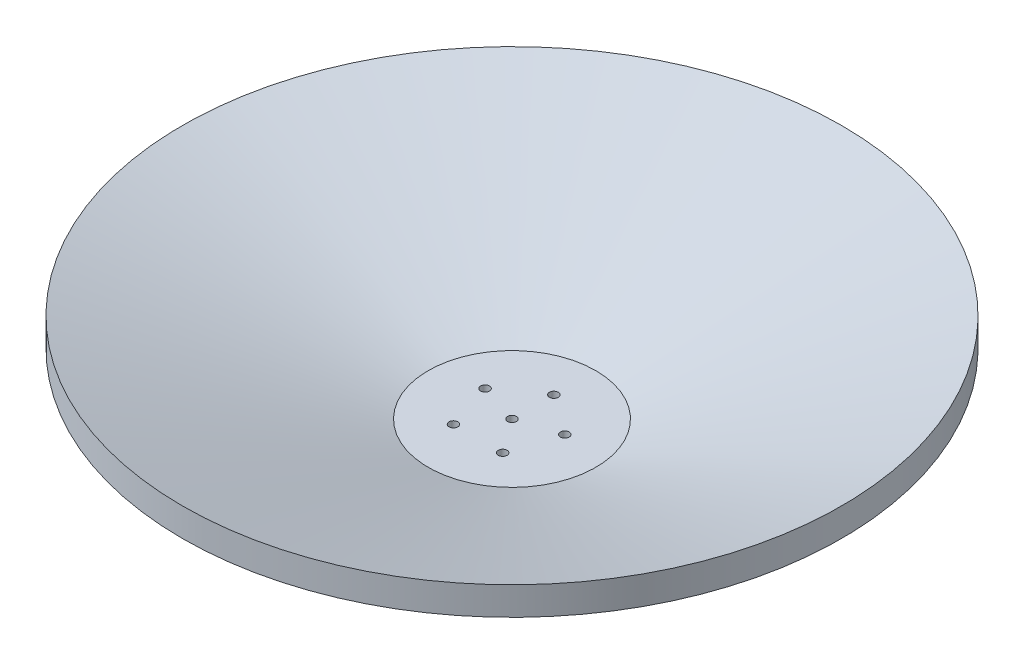
ISO-10303-21;
HEADER;
FILE_DESCRIPTION(('STEP AP214'),'2;1');
FILE_NAME('part.step','',(''),(''),'','','');
FILE_SCHEMA(('AUTOMOTIVE_DESIGN { 1 0 10303 214 1 1 1 1 }'));
ENDSEC;
DATA;
#1=APPLICATION_CONTEXT('core data for automotive mechanical design processes');
#2=APPLICATION_PROTOCOL_DEFINITION('international standard','automotive_design',2000,#1);
#3=PRODUCT_CONTEXT('',#1,'mechanical');
#4=PRODUCT('Part','Part','',(#3));
#5=PRODUCT_RELATED_PRODUCT_CATEGORY('part','',(#4));
#6=PRODUCT_DEFINITION_FORMATION('','',#4);
#7=PRODUCT_DEFINITION_CONTEXT('part definition',#1,'design');
#8=PRODUCT_DEFINITION('design','',#6,#7);
#9=PRODUCT_DEFINITION_SHAPE('','',#8);
#10=(LENGTH_UNIT() NAMED_UNIT(*) SI_UNIT(.MILLI.,.METRE.));
#11=(NAMED_UNIT(*) PLANE_ANGLE_UNIT() SI_UNIT($,.RADIAN.));
#12=(NAMED_UNIT(*) SI_UNIT($,.STERADIAN.) SOLID_ANGLE_UNIT());
#13=UNCERTAINTY_MEASURE_WITH_UNIT(LENGTH_MEASURE(1.E-05),#10,'distance_accuracy_value','');
#14=(GEOMETRIC_REPRESENTATION_CONTEXT(3) GLOBAL_UNCERTAINTY_ASSIGNED_CONTEXT((#13)) GLOBAL_UNIT_ASSIGNED_CONTEXT((#10,
#11,#12)) REPRESENTATION_CONTEXT('',''));
#15=CARTESIAN_POINT('',(0.,0.,0.));
#16=DIRECTION('',(0.,0.,1.));
#17=DIRECTION('',(1.,0.,0.));
#18=AXIS2_PLACEMENT_3D('',#15,#16,#17);
#19=CARTESIAN_POINT('',(0.,3.,0.));
#20=DIRECTION('',(0.,1.,0.));
#21=DIRECTION('',(0.,0.,1.));
#22=AXIS2_PLACEMENT_3D('',#19,#20,#21);
#23=PLANE('',#22);
#24=CARTESIAN_POINT('',(4.50373719547362,3.,-1.46335292146612));
#25=DIRECTION('',(0.,1.,0.));
#26=DIRECTION('',(0.,0.,1.));
#27=AXIS2_PLACEMENT_3D('',#24,#25,#26);
#28=CIRCLE('',#27,0.500000000000001);
#29=CARTESIAN_POINT('',(4.50373719547362,3.,-0.963352921466115));
#30=VERTEX_POINT('',#29);
#31=EDGE_CURVE('E65',#30,#30,#28,.T.);
#32=ORIENTED_EDGE('',*,*,#31,.F.);
#33=EDGE_LOOP('',(#32));
#34=FACE_BOUND('',#33,.T.);
#35=CARTESIAN_POINT('',(0.,3.,0.));
#36=DIRECTION('',(0.,1.,0.));
#37=DIRECTION('',(0.,0.,1.));
#38=AXIS2_PLACEMENT_3D('',#35,#36,#37);
#39=CIRCLE('',#38,0.5);
#40=CARTESIAN_POINT('',(0.,3.,0.5));
#41=VERTEX_POINT('',#40);
#42=EDGE_CURVE('E110',#41,#41,#39,.T.);
#43=ORIENTED_EDGE('',*,*,#42,.F.);
#44=EDGE_LOOP('',(#43));
#45=FACE_BOUND('',#44,.T.);
#46=CARTESIAN_POINT('',(0.,3.,-4.7355095289373));
#47=DIRECTION('',(0.,1.,0.));
#48=DIRECTION('',(0.,0.,1.));
#49=AXIS2_PLACEMENT_3D('',#46,#47,#48);
#50=CIRCLE('',#49,0.5);
#51=CARTESIAN_POINT('',(0.,3.,-4.2355095289373));
#52=VERTEX_POINT('',#51);
#53=EDGE_CURVE('E106',#52,#52,#50,.T.);
#54=ORIENTED_EDGE('',*,*,#53,.F.);
#55=EDGE_LOOP('',(#54));
#56=FACE_BOUND('',#55,.T.);
#57=CARTESIAN_POINT('',(2.7834626631998,3.,3.83110768593479));
#58=DIRECTION('',(0.,1.,0.));
#59=DIRECTION('',(0.,0.,1.));
#60=AXIS2_PLACEMENT_3D('',#57,#58,#59);
#61=CIRCLE('',#60,0.5);
#62=CARTESIAN_POINT('',(2.7834626631998,3.,4.33110768593479));
#63=VERTEX_POINT('',#62);
#64=EDGE_CURVE('E102',#63,#63,#61,.T.);
#65=ORIENTED_EDGE('',*,*,#64,.F.);
#66=EDGE_LOOP('',(#65));
#67=FACE_BOUND('',#66,.T.);
#68=CARTESIAN_POINT('',(-2.78346266319986,3.,3.83110768593475));
#69=DIRECTION('',(0.,1.,0.));
#70=DIRECTION('',(0.,0.,1.));
#71=AXIS2_PLACEMENT_3D('',#68,#69,#70);
#72=CIRCLE('',#71,0.5);
#73=CARTESIAN_POINT('',(-2.78346266319986,3.,4.33110768593475));
#74=VERTEX_POINT('',#73);
#75=EDGE_CURVE('E98',#74,#74,#72,.T.);
#76=ORIENTED_EDGE('',*,*,#75,.F.);
#77=EDGE_LOOP('',(#76));
#78=FACE_BOUND('',#77,.T.);
#79=CARTESIAN_POINT('',(-4.5037371954736,3.,-1.46335292146618));
#80=DIRECTION('',(0.,1.,0.));
#81=DIRECTION('',(0.,0.,1.));
#82=AXIS2_PLACEMENT_3D('',#79,#80,#81);
#83=CIRCLE('',#82,0.5);
#84=CARTESIAN_POINT('',(-4.5037371954736,3.,-0.963352921466179));
#85=VERTEX_POINT('',#84);
#86=EDGE_CURVE('E94',#85,#85,#83,.T.);
#87=ORIENTED_EDGE('',*,*,#86,.F.);
#88=EDGE_LOOP('',(#87));
#89=FACE_BOUND('',#88,.T.);
#90=CARTESIAN_POINT('',(0.,3.,0.));
#91=DIRECTION('',(0.,-1.,0.));
#92=DIRECTION('',(0.,0.,-1.));
#93=AXIS2_PLACEMENT_3D('',#90,#91,#92);
#94=CIRCLE('',#93,9.4710190578746);
#95=CARTESIAN_POINT('',(0.,3.,-9.4710190578746));
#96=VERTEX_POINT('',#95);
#97=EDGE_CURVE('E10',#96,#96,#94,.T.);
#98=ORIENTED_EDGE('',*,*,#97,.F.);
#99=EDGE_LOOP('',(#98));
#100=FACE_BOUND('',#99,.T.);
#101=ADVANCED_FACE('F42',(#34,#45,#56,#67,#78,#89,#100),#23,.T.);
#102=CARTESIAN_POINT('',(0.,13.1107222011818,0.));
#103=DIRECTION('',(0.,1.,0.));
#104=DIRECTION('',(0.,0.,1.));
#105=AXIS2_PLACEMENT_3D('',#102,#103,#104);
#106=CONICAL_SURFACE('',#105,37.25,1.22173047639603);
#107=ORIENTED_EDGE('',*,*,#97,.T.);
#108=EDGE_LOOP('',(#107));
#109=FACE_BOUND('',#108,.T.);
#110=CARTESIAN_POINT('',(0.,13.1107222011818,0.));
#111=DIRECTION('',(0.,-1.,0.));
#112=DIRECTION('',(0.,0.,-1.));
#113=AXIS2_PLACEMENT_3D('',#110,#111,#112);
#114=CIRCLE('',#113,37.25);
#115=CARTESIAN_POINT('',(0.,13.1107222011818,-37.25));
#116=VERTEX_POINT('',#115);
#117=EDGE_CURVE('E50',#116,#116,#114,.T.);
#118=ORIENTED_EDGE('',*,*,#117,.F.);
#119=EDGE_LOOP('',(#118));
#120=FACE_BOUND('',#119,.T.);
#121=ADVANCED_FACE('F122',(#109,#120),#106,.F.);
#122=CARTESIAN_POINT('',(0.,0.,0.));
#123=DIRECTION('',(0.,-1.,0.));
#124=DIRECTION('',(0.,0.,-1.));
#125=AXIS2_PLACEMENT_3D('',#122,#123,#124);
#126=CYLINDRICAL_SURFACE('',#125,37.25);
#127=ORIENTED_EDGE('',*,*,#117,.T.);
#128=EDGE_LOOP('',(#127));
#129=FACE_BOUND('',#128,.T.);
#130=CARTESIAN_POINT('',(0.,9.91818888375406,0.));
#131=DIRECTION('',(0.,-1.,0.));
#132=DIRECTION('',(0.,0.,-1.));
#133=AXIS2_PLACEMENT_3D('',#130,#131,#132);
#134=CIRCLE('',#133,37.25);
#135=CARTESIAN_POINT('',(0.,9.91818888375406,-37.25));
#136=VERTEX_POINT('',#135);
#137=EDGE_CURVE('E56',#136,#136,#134,.T.);
#138=ORIENTED_EDGE('',*,*,#137,.F.);
#139=EDGE_LOOP('',(#138));
#140=FACE_BOUND('',#139,.T.);
#141=ADVANCED_FACE('F154',(#129,#140),#126,.T.);
#142=CARTESIAN_POINT('',(0.,0.,0.));
#143=DIRECTION('',(0.,1.,0.));
#144=DIRECTION('',(0.,0.,1.));
#145=AXIS2_PLACEMENT_3D('',#142,#143,#144);
#146=CONICAL_SURFACE('',#145,10.,1.22173047639603);
#147=ORIENTED_EDGE('',*,*,#137,.T.);
#148=EDGE_LOOP('',(#147));
#149=FACE_BOUND('',#148,.T.);
#150=CARTESIAN_POINT('',(0.,0.,0.));
#151=DIRECTION('',(0.,-1.,0.));
#152=DIRECTION('',(0.,0.,-1.));
#153=AXIS2_PLACEMENT_3D('',#150,#151,#152);
#154=CIRCLE('',#153,10.);
#155=CARTESIAN_POINT('',(0.,0.,-10.));
#156=VERTEX_POINT('',#155);
#157=EDGE_CURVE('E83',#156,#156,#154,.T.);
#158=ORIENTED_EDGE('',*,*,#157,.F.);
#159=EDGE_LOOP('',(#158));
#160=FACE_BOUND('',#159,.T.);
#161=ADVANCED_FACE('F147',(#149,#160),#146,.T.);
#162=CARTESIAN_POINT('',(0.,0.,0.));
#163=DIRECTION('',(0.,-1.,0.));
#164=DIRECTION('',(0.,0.,-1.));
#165=AXIS2_PLACEMENT_3D('',#162,#163,#164);
#166=PLANE('',#165);
#167=CARTESIAN_POINT('',(4.50373719547362,0.,-1.46335292146612));
#168=DIRECTION('',(0.,-1.,0.));
#169=DIRECTION('',(0.,0.,-1.));
#170=AXIS2_PLACEMENT_3D('',#167,#168,#169);
#171=CIRCLE('',#170,0.500000000000001);
#172=CARTESIAN_POINT('',(4.50373719547362,0.,-1.96335292146612));
#173=VERTEX_POINT('',#172);
#174=EDGE_CURVE('E45',#173,#173,#171,.T.);
#175=ORIENTED_EDGE('',*,*,#174,.F.);
#176=EDGE_LOOP('',(#175));
#177=FACE_BOUND('',#176,.T.);
#178=CARTESIAN_POINT('',(0.,0.,0.));
#179=DIRECTION('',(0.,-1.,0.));
#180=DIRECTION('',(0.,0.,-1.));
#181=AXIS2_PLACEMENT_3D('',#178,#179,#180);
#182=CIRCLE('',#181,0.5);
#183=CARTESIAN_POINT('',(0.,0.,-0.5));
#184=VERTEX_POINT('',#183);
#185=EDGE_CURVE('E76',#184,#184,#182,.T.);
#186=ORIENTED_EDGE('',*,*,#185,.F.);
#187=EDGE_LOOP('',(#186));
#188=FACE_BOUND('',#187,.T.);
#189=CARTESIAN_POINT('',(0.,0.,-4.7355095289373));
#190=DIRECTION('',(0.,-1.,0.));
#191=DIRECTION('',(0.,0.,-1.));
#192=AXIS2_PLACEMENT_3D('',#189,#190,#191);
#193=CIRCLE('',#192,0.5);
#194=CARTESIAN_POINT('',(0.,0.,-5.2355095289373));
#195=VERTEX_POINT('',#194);
#196=EDGE_CURVE('E73',#195,#195,#193,.T.);
#197=ORIENTED_EDGE('',*,*,#196,.F.);
#198=EDGE_LOOP('',(#197));
#199=FACE_BOUND('',#198,.T.);
#200=CARTESIAN_POINT('',(2.7834626631998,0.,3.83110768593479));
#201=DIRECTION('',(0.,-1.,0.));
#202=DIRECTION('',(0.,0.,-1.));
#203=AXIS2_PLACEMENT_3D('',#200,#201,#202);
#204=CIRCLE('',#203,0.5);
#205=CARTESIAN_POINT('',(2.7834626631998,0.,3.33110768593479));
#206=VERTEX_POINT('',#205);
#207=EDGE_CURVE('E69',#206,#206,#204,.T.);
#208=ORIENTED_EDGE('',*,*,#207,.F.);
#209=EDGE_LOOP('',(#208));
#210=FACE_BOUND('',#209,.T.);
#211=CARTESIAN_POINT('',(-2.78346266319986,0.,3.83110768593475));
#212=DIRECTION('',(0.,-1.,0.));
#213=DIRECTION('',(0.,0.,-1.));
#214=AXIS2_PLACEMENT_3D('',#211,#212,#213);
#215=CIRCLE('',#214,0.5);
#216=CARTESIAN_POINT('',(-2.78346266319986,0.,3.33110768593475));
#217=VERTEX_POINT('',#216);
#218=EDGE_CURVE('E64',#217,#217,#215,.T.);
#219=ORIENTED_EDGE('',*,*,#218,.F.);
#220=EDGE_LOOP('',(#219));
#221=FACE_BOUND('',#220,.T.);
#222=CARTESIAN_POINT('',(-4.5037371954736,0.,-1.46335292146618));
#223=DIRECTION('',(0.,-1.,0.));
#224=DIRECTION('',(0.,0.,-1.));
#225=AXIS2_PLACEMENT_3D('',#222,#223,#224);
#226=CIRCLE('',#225,0.5);
#227=CARTESIAN_POINT('',(-4.5037371954736,0.,-1.96335292146618));
#228=VERTEX_POINT('',#227);
#229=EDGE_CURVE('E60',#228,#228,#226,.T.);
#230=ORIENTED_EDGE('',*,*,#229,.F.);
#231=EDGE_LOOP('',(#230));
#232=FACE_BOUND('',#231,.T.);
#233=ORIENTED_EDGE('',*,*,#157,.T.);
#234=EDGE_LOOP('',(#233));
#235=FACE_BOUND('',#234,.T.);
#236=ADVANCED_FACE('F137',(#177,#188,#199,#210,#221,#232,#235),#166,.T.);
#237=CARTESIAN_POINT('',(-4.5037371954736,-15.,-1.46335292146618));
#238=DIRECTION('',(0.,1.,0.));
#239=DIRECTION('',(0.,0.,1.));
#240=AXIS2_PLACEMENT_3D('',#237,#238,#239);
#241=CYLINDRICAL_SURFACE('',#240,0.5);
#242=ORIENTED_EDGE('',*,*,#229,.T.);
#243=EDGE_LOOP('',(#242));
#244=FACE_BOUND('',#243,.T.);
#245=ORIENTED_EDGE('',*,*,#86,.T.);
#246=EDGE_LOOP('',(#245));
#247=FACE_BOUND('',#246,.T.);
#248=ADVANCED_FACE('F134',(#244,#247),#241,.F.);
#249=CARTESIAN_POINT('',(-2.78346266319986,-15.,3.83110768593475));
#250=DIRECTION('',(0.,1.,0.));
#251=DIRECTION('',(0.,0.,1.));
#252=AXIS2_PLACEMENT_3D('',#249,#250,#251);
#253=CYLINDRICAL_SURFACE('',#252,0.5);
#254=ORIENTED_EDGE('',*,*,#218,.T.);
#255=EDGE_LOOP('',(#254));
#256=FACE_BOUND('',#255,.T.);
#257=ORIENTED_EDGE('',*,*,#75,.T.);
#258=EDGE_LOOP('',(#257));
#259=FACE_BOUND('',#258,.T.);
#260=ADVANCED_FACE('F136',(#256,#259),#253,.F.);
#261=CARTESIAN_POINT('',(2.7834626631998,-15.,3.83110768593479));
#262=DIRECTION('',(0.,1.,0.));
#263=DIRECTION('',(0.,0.,1.));
#264=AXIS2_PLACEMENT_3D('',#261,#262,#263);
#265=CYLINDRICAL_SURFACE('',#264,0.5);
#266=ORIENTED_EDGE('',*,*,#207,.T.);
#267=EDGE_LOOP('',(#266));
#268=FACE_BOUND('',#267,.T.);
#269=ORIENTED_EDGE('',*,*,#64,.T.);
#270=EDGE_LOOP('',(#269));
#271=FACE_BOUND('',#270,.T.);
#272=ADVANCED_FACE('F144',(#268,#271),#265,.F.);
#273=CARTESIAN_POINT('',(0.,-15.,-4.7355095289373));
#274=DIRECTION('',(0.,1.,0.));
#275=DIRECTION('',(0.,0.,1.));
#276=AXIS2_PLACEMENT_3D('',#273,#274,#275);
#277=CYLINDRICAL_SURFACE('',#276,0.5);
#278=ORIENTED_EDGE('',*,*,#196,.T.);
#279=EDGE_LOOP('',(#278));
#280=FACE_BOUND('',#279,.T.);
#281=ORIENTED_EDGE('',*,*,#53,.T.);
#282=EDGE_LOOP('',(#281));
#283=FACE_BOUND('',#282,.T.);
#284=ADVANCED_FACE('F206',(#280,#283),#277,.F.);
#285=CARTESIAN_POINT('',(0.,-15.,0.));
#286=DIRECTION('',(0.,1.,0.));
#287=DIRECTION('',(0.,0.,1.));
#288=AXIS2_PLACEMENT_3D('',#285,#286,#287);
#289=CYLINDRICAL_SURFACE('',#288,0.5);
#290=ORIENTED_EDGE('',*,*,#185,.T.);
#291=EDGE_LOOP('',(#290));
#292=FACE_BOUND('',#291,.T.);
#293=ORIENTED_EDGE('',*,*,#42,.T.);
#294=EDGE_LOOP('',(#293));
#295=FACE_BOUND('',#294,.T.);
#296=ADVANCED_FACE('F215',(#292,#295),#289,.F.);
#297=CARTESIAN_POINT('',(4.50373719547362,-15.,-1.46335292146612));
#298=DIRECTION('',(0.,1.,0.));
#299=DIRECTION('',(0.,0.,1.));
#300=AXIS2_PLACEMENT_3D('',#297,#298,#299);
#301=CYLINDRICAL_SURFACE('',#300,0.500000000000001);
#302=ORIENTED_EDGE('',*,*,#174,.T.);
#303=EDGE_LOOP('',(#302));
#304=FACE_BOUND('',#303,.T.);
#305=ORIENTED_EDGE('',*,*,#31,.T.);
#306=EDGE_LOOP('',(#305));
#307=FACE_BOUND('',#306,.T.);
#308=ADVANCED_FACE('F118',(#304,#307),#301,.F.);
#309=CLOSED_SHELL('',(#101,#121,#141,#161,#236,#248,#260,#272,#284,#296,#308));
#310=MANIFOLD_SOLID_BREP('B2',#309);
#311=ADVANCED_BREP_SHAPE_REPRESENTATION('',(#18,#310),#14);
#312=SHAPE_DEFINITION_REPRESENTATION(#9,#311);
ENDSEC;
END-ISO-10303-21;
